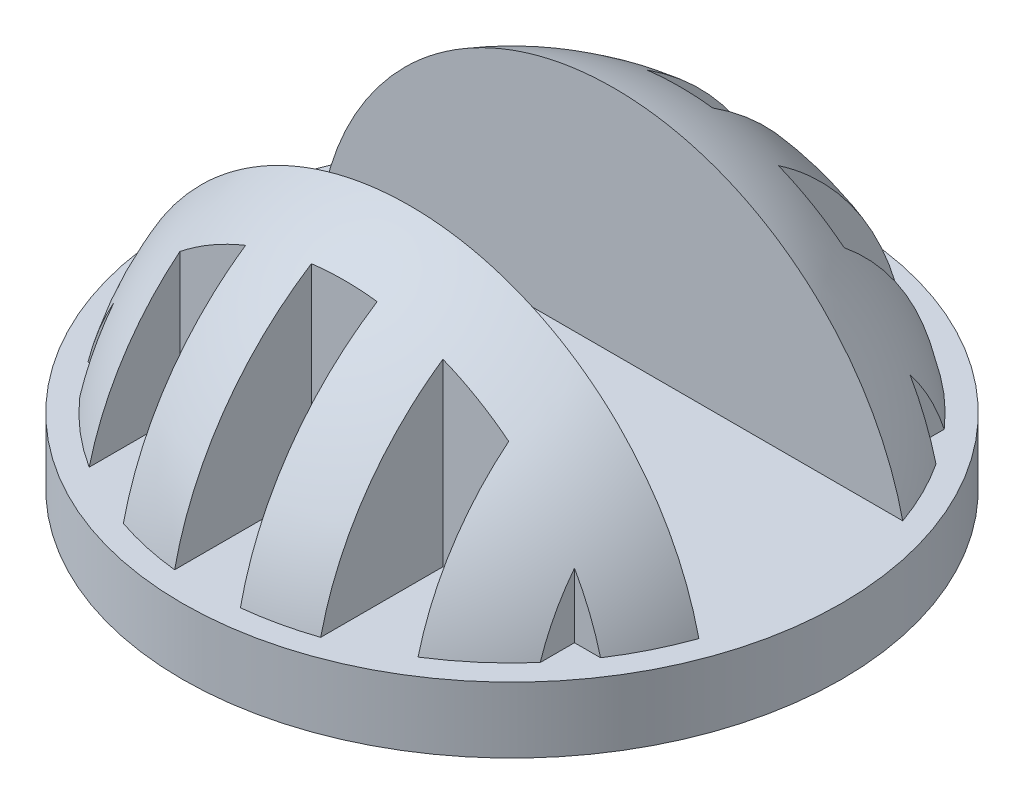
ISO-10303-21;
HEADER;
FILE_DESCRIPTION(('STEP AP214'),'2;1');
FILE_NAME('part.step','',(''),(''),'','','');
FILE_SCHEMA(('AUTOMOTIVE_DESIGN { 1 0 10303 214 1 1 1 1 }'));
ENDSEC;
DATA;
#1=APPLICATION_CONTEXT('core data for automotive mechanical design processes');
#2=APPLICATION_PROTOCOL_DEFINITION('international standard','automotive_design',2000,#1);
#3=PRODUCT_CONTEXT('',#1,'mechanical');
#4=PRODUCT('Part','Part','',(#3));
#5=PRODUCT_RELATED_PRODUCT_CATEGORY('part','',(#4));
#6=PRODUCT_DEFINITION_FORMATION('','',#4);
#7=PRODUCT_DEFINITION_CONTEXT('part definition',#1,'design');
#8=PRODUCT_DEFINITION('design','',#6,#7);
#9=PRODUCT_DEFINITION_SHAPE('','',#8);
#10=(LENGTH_UNIT() NAMED_UNIT(*) SI_UNIT(.MILLI.,.METRE.));
#11=(NAMED_UNIT(*) PLANE_ANGLE_UNIT() SI_UNIT($,.RADIAN.));
#12=(NAMED_UNIT(*) SI_UNIT($,.STERADIAN.) SOLID_ANGLE_UNIT());
#13=UNCERTAINTY_MEASURE_WITH_UNIT(LENGTH_MEASURE(1.E-05),#10,'distance_accuracy_value','');
#14=(GEOMETRIC_REPRESENTATION_CONTEXT(3) GLOBAL_UNCERTAINTY_ASSIGNED_CONTEXT((#13)) GLOBAL_UNIT_ASSIGNED_CONTEXT((#10,
#11,#12)) REPRESENTATION_CONTEXT('',''));
#15=CARTESIAN_POINT('',(0.,0.,0.));
#16=DIRECTION('',(0.,0.,1.));
#17=DIRECTION('',(1.,0.,0.));
#18=AXIS2_PLACEMENT_3D('',#15,#16,#17);
#19=CARTESIAN_POINT('',(0.,0.,0.));
#20=DIRECTION('',(0.,-1.,0.));
#21=DIRECTION('',(1.,0.,0.));
#22=AXIS2_PLACEMENT_3D('',#19,#20,#21);
#23=SPHERICAL_SURFACE('',#22,9.525);
#24=CARTESIAN_POINT('',(-7.,0.,0.));
#25=DIRECTION('',(-1.,0.,0.));
#26=DIRECTION('',(0.,0.,1.));
#27=AXIS2_PLACEMENT_3D('',#24,#25,#26);
#28=CIRCLE('',#27,6.45953752214507);
#29=CARTESIAN_POINT('',(-7.,2.,-6.14211893404874));
#30=VERTEX_POINT('',#29);
#31=CARTESIAN_POINT('',(-7.,3.96429375803567,-5.09999999999994));
#32=VERTEX_POINT('',#31);
#33=EDGE_CURVE('E232',#30,#32,#28,.F.);
#34=ORIENTED_EDGE('',*,*,#33,.T.);
#35=CARTESIAN_POINT('',(0.,0.,-5.09999999999994));
#36=DIRECTION('',(0.,0.,-1.));
#37=DIRECTION('',(-1.,0.,0.));
#38=AXIS2_PLACEMENT_3D('',#35,#36,#37);
#39=CIRCLE('',#38,8.04460222758096);
#40=CARTESIAN_POINT('',(-7.79202316475,2.,-5.09999999999994));
#41=VERTEX_POINT('',#40);
#42=EDGE_CURVE('E229',#32,#41,#39,.F.);
#43=ORIENTED_EDGE('',*,*,#42,.T.);
#44=CARTESIAN_POINT('',(0.,2.,0.));
#45=DIRECTION('',(0.,-1.,0.));
#46=DIRECTION('',(0.,0.,-1.));
#47=AXIS2_PLACEMENT_3D('',#44,#45,#46);
#48=CIRCLE('',#47,9.31265939460904);
#49=CARTESIAN_POINT('',(-8.78155026177041,2.,-3.1));
#50=VERTEX_POINT('',#49);
#51=EDGE_CURVE('E222',#41,#50,#48,.F.);
#52=ORIENTED_EDGE('',*,*,#51,.T.);
#53=CARTESIAN_POINT('',(0.,0.,-3.1));
#54=DIRECTION('',(0.,0.,1.));
#55=DIRECTION('',(1.,0.,0.));
#56=AXIS2_PLACEMENT_3D('',#53,#54,#55);
#57=CIRCLE('',#56,9.00642132036915);
#58=CARTESIAN_POINT('',(8.78155026177041,2.,-3.1));
#59=VERTEX_POINT('',#58);
#60=EDGE_CURVE('E398',#50,#59,#57,.F.);
#61=ORIENTED_EDGE('',*,*,#60,.T.);
#62=CARTESIAN_POINT('',(7.79202316474996,2.,-5.1));
#63=VERTEX_POINT('',#62);
#64=EDGE_CURVE('E407',#59,#63,#48,.F.);
#65=ORIENTED_EDGE('',*,*,#64,.T.);
#66=CARTESIAN_POINT('',(0.,0.,-5.1));
#67=DIRECTION('',(0.,0.,-1.));
#68=DIRECTION('',(-1.,0.,0.));
#69=AXIS2_PLACEMENT_3D('',#66,#67,#68);
#70=CIRCLE('',#69,8.04460222758093);
#71=CARTESIAN_POINT('',(7.,3.9642937580356,-5.1));
#72=VERTEX_POINT('',#71);
#73=EDGE_CURVE('E277',#63,#72,#70,.F.);
#74=ORIENTED_EDGE('',*,*,#73,.T.);
#75=CARTESIAN_POINT('',(7.,0.,0.));
#76=DIRECTION('',(1.,0.,0.));
#77=DIRECTION('',(0.,0.,-1.));
#78=AXIS2_PLACEMENT_3D('',#75,#76,#77);
#79=CIRCLE('',#78,6.45953752214507);
#80=CARTESIAN_POINT('',(7.,2.,-6.14211893404874));
#81=VERTEX_POINT('',#80);
#82=EDGE_CURVE('E280',#72,#81,#79,.F.);
#83=ORIENTED_EDGE('',*,*,#82,.T.);
#84=CARTESIAN_POINT('',(5.,2.,-7.85656572555719));
#85=VERTEX_POINT('',#84);
#86=EDGE_CURVE('E411',#81,#85,#48,.F.);
#87=ORIENTED_EDGE('',*,*,#86,.T.);
#88=CARTESIAN_POINT('',(5.,0.,0.));
#89=DIRECTION('',(-1.,0.,0.));
#90=DIRECTION('',(0.,0.,1.));
#91=AXIS2_PLACEMENT_3D('',#88,#89,#90);
#92=CIRCLE('',#91,8.10713420389721);
#93=CARTESIAN_POINT('',(5.,6.30203340200605,-5.1));
#94=VERTEX_POINT('',#93);
#95=EDGE_CURVE('E309',#85,#94,#92,.F.);
#96=ORIENTED_EDGE('',*,*,#95,.T.);
#97=CARTESIAN_POINT('',(0.,0.,-5.1));
#98=DIRECTION('',(0.,0.,-1.));
#99=DIRECTION('',(-1.,0.,0.));
#100=AXIS2_PLACEMENT_3D('',#97,#98,#99);
#101=CIRCLE('',#100,8.04460222758093);
#102=CARTESIAN_POINT('',(3.,7.46428998632824,-5.1));
#103=VERTEX_POINT('',#102);
#104=EDGE_CURVE('E40',#94,#103,#101,.F.);
#105=ORIENTED_EDGE('',*,*,#104,.T.);
#106=CARTESIAN_POINT('',(3.,0.,0.));
#107=DIRECTION('',(1.,0.,0.));
#108=DIRECTION('',(0.,0.,-1.));
#109=AXIS2_PLACEMENT_3D('',#106,#107,#108);
#110=CIRCLE('',#109,9.04022261894031);
#111=CARTESIAN_POINT('',(3.,2.,-8.81621375648299));
#112=VERTEX_POINT('',#111);
#113=EDGE_CURVE('E312',#103,#112,#110,.F.);
#114=ORIENTED_EDGE('',*,*,#113,.T.);
#115=CARTESIAN_POINT('',(1.,2.,-9.25881336889345));
#116=VERTEX_POINT('',#115);
#117=EDGE_CURVE('E437',#112,#116,#48,.F.);
#118=ORIENTED_EDGE('',*,*,#117,.T.);
#119=CARTESIAN_POINT('',(1.,0.,0.));
#120=DIRECTION('',(-1.,0.,0.));
#121=DIRECTION('',(0.,0.,1.));
#122=AXIS2_PLACEMENT_3D('',#119,#120,#121);
#123=CIRCLE('',#122,9.47236111009288);
#124=CARTESIAN_POINT('',(1.,7.98220677507167,-5.1));
#125=VERTEX_POINT('',#124);
#126=EDGE_CURVE('E365',#116,#125,#123,.F.);
#127=ORIENTED_EDGE('',*,*,#126,.T.);
#128=CARTESIAN_POINT('',(0.,0.,-5.1));
#129=DIRECTION('',(0.,0.,-1.));
#130=DIRECTION('',(-1.,0.,0.));
#131=AXIS2_PLACEMENT_3D('',#128,#129,#130);
#132=CIRCLE('',#131,8.04460222758093);
#133=CARTESIAN_POINT('',(-1.,7.98220677507167,-5.1));
#134=VERTEX_POINT('',#133);
#135=EDGE_CURVE('E416',#125,#134,#132,.F.);
#136=ORIENTED_EDGE('',*,*,#135,.T.);
#137=CARTESIAN_POINT('',(-1.,0.,0.));
#138=DIRECTION('',(1.,0.,0.));
#139=DIRECTION('',(0.,0.,-1.));
#140=AXIS2_PLACEMENT_3D('',#137,#138,#139);
#141=CIRCLE('',#140,9.47236111009288);
#142=CARTESIAN_POINT('',(-1.,2.,-9.25881336889345));
#143=VERTEX_POINT('',#142);
#144=EDGE_CURVE('E368',#134,#143,#141,.F.);
#145=ORIENTED_EDGE('',*,*,#144,.T.);
#146=CARTESIAN_POINT('',(-3.,2.,-8.81621375648299));
#147=VERTEX_POINT('',#146);
#148=EDGE_CURVE('E477',#143,#147,#48,.F.);
#149=ORIENTED_EDGE('',*,*,#148,.T.);
#150=CARTESIAN_POINT('',(-3.,0.,0.));
#151=DIRECTION('',(-1.,0.,0.));
#152=DIRECTION('',(0.,0.,1.));
#153=AXIS2_PLACEMENT_3D('',#150,#151,#152);
#154=CIRCLE('',#153,9.04022261894031);
#155=CARTESIAN_POINT('',(-3.,7.46428998632826,-5.09999999999997));
#156=VERTEX_POINT('',#155);
#157=EDGE_CURVE('E264',#147,#156,#154,.F.);
#158=ORIENTED_EDGE('',*,*,#157,.T.);
#159=CARTESIAN_POINT('',(0.,0.,-5.09999999999997));
#160=DIRECTION('',(0.,0.,-1.));
#161=DIRECTION('',(-1.,0.,0.));
#162=AXIS2_PLACEMENT_3D('',#159,#160,#161);
#163=CIRCLE('',#162,8.04460222758094);
#164=CARTESIAN_POINT('',(-5.,6.30203340200608,-5.09999999999997));
#165=VERTEX_POINT('',#164);
#166=EDGE_CURVE('E11',#156,#165,#163,.F.);
#167=ORIENTED_EDGE('',*,*,#166,.T.);
#168=CARTESIAN_POINT('',(-5.,0.,0.));
#169=DIRECTION('',(1.,0.,0.));
#170=DIRECTION('',(0.,0.,-1.));
#171=AXIS2_PLACEMENT_3D('',#168,#169,#170);
#172=CIRCLE('',#171,8.10713420389721);
#173=CARTESIAN_POINT('',(-5.,2.,-7.85656572555719));
#174=VERTEX_POINT('',#173);
#175=EDGE_CURVE('E267',#165,#174,#172,.F.);
#176=ORIENTED_EDGE('',*,*,#175,.T.);
#177=EDGE_CURVE('E474',#174,#30,#48,.F.);
#178=ORIENTED_EDGE('',*,*,#177,.T.);
#179=EDGE_LOOP('',(#34,#43,#52,#61,#65,#74,#83,#87,#96,#105,#114,#118,#127,#136,#145,#149,#158,
#167,#176,#178));
#180=FACE_BOUND('',#179,.T.);
#181=ADVANCED_FACE('F33',(#180),#23,.T.);
#182=CARTESIAN_POINT('',(0.,0.,5.10000000000006));
#183=DIRECTION('',(0.,0.,1.));
#184=DIRECTION('',(1.,0.,0.));
#185=AXIS2_PLACEMENT_3D('',#182,#183,#184);
#186=CIRCLE('',#185,8.04460222758089);
#187=CARTESIAN_POINT('',(-7.79202316474992,2.,5.10000000000006));
#188=VERTEX_POINT('',#187);
#189=CARTESIAN_POINT('',(-7.,3.96429375803553,5.10000000000006));
#190=VERTEX_POINT('',#189);
#191=EDGE_CURVE('E246',#188,#190,#186,.F.);
#192=ORIENTED_EDGE('',*,*,#191,.T.);
#193=CARTESIAN_POINT('',(-7.,0.,0.));
#194=DIRECTION('',(-1.,0.,0.));
#195=DIRECTION('',(0.,0.,1.));
#196=AXIS2_PLACEMENT_3D('',#193,#194,#195);
#197=CIRCLE('',#196,6.45953752214507);
#198=CARTESIAN_POINT('',(-7.,2.,6.14211893404874));
#199=VERTEX_POINT('',#198);
#200=EDGE_CURVE('E249',#190,#199,#197,.F.);
#201=ORIENTED_EDGE('',*,*,#200,.T.);
#202=CARTESIAN_POINT('',(-5.,2.,7.85656572555719));
#203=VERTEX_POINT('',#202);
#204=EDGE_CURVE('E470',#199,#203,#48,.F.);
#205=ORIENTED_EDGE('',*,*,#204,.T.);
#206=CARTESIAN_POINT('',(-5.,0.,0.));
#207=DIRECTION('',(1.,0.,0.));
#208=DIRECTION('',(0.,0.,-1.));
#209=AXIS2_PLACEMENT_3D('',#206,#207,#208);
#210=CIRCLE('',#209,8.10713420389721);
#211=CARTESIAN_POINT('',(-5.,6.30203340200603,5.10000000000003));
#212=VERTEX_POINT('',#211);
#213=EDGE_CURVE('E331',#203,#212,#210,.F.);
#214=ORIENTED_EDGE('',*,*,#213,.T.);
#215=CARTESIAN_POINT('',(0.,0.,5.10000000000003));
#216=DIRECTION('',(0.,0.,1.));
#217=DIRECTION('',(1.,0.,0.));
#218=AXIS2_PLACEMENT_3D('',#215,#216,#217);
#219=CIRCLE('',#218,8.04460222758091);
#220=CARTESIAN_POINT('',(-3.,7.46428998632822,5.10000000000003));
#221=VERTEX_POINT('',#220);
#222=EDGE_CURVE('E422',#212,#221,#219,.F.);
#223=ORIENTED_EDGE('',*,*,#222,.T.);
#224=CARTESIAN_POINT('',(-3.,0.,0.));
#225=DIRECTION('',(-1.,0.,0.));
#226=DIRECTION('',(0.,0.,1.));
#227=AXIS2_PLACEMENT_3D('',#224,#225,#226);
#228=CIRCLE('',#227,9.04022261894031);
#229=CARTESIAN_POINT('',(-3.,2.,8.81621375648299));
#230=VERTEX_POINT('',#229);
#231=EDGE_CURVE('E328',#221,#230,#228,.F.);
#232=ORIENTED_EDGE('',*,*,#231,.T.);
#233=CARTESIAN_POINT('',(-1.,2.,9.25881336889345));
#234=VERTEX_POINT('',#233);
#235=EDGE_CURVE('E473',#230,#234,#48,.F.);
#236=ORIENTED_EDGE('',*,*,#235,.T.);
#237=CARTESIAN_POINT('',(-1.,0.,0.));
#238=DIRECTION('',(1.,0.,0.));
#239=DIRECTION('',(0.,0.,-1.));
#240=AXIS2_PLACEMENT_3D('',#237,#238,#239);
#241=CIRCLE('',#240,9.47236111009288);
#242=CARTESIAN_POINT('',(-1.,7.98220677507167,5.1));
#243=VERTEX_POINT('',#242);
#244=EDGE_CURVE('E387',#234,#243,#241,.F.);
#245=ORIENTED_EDGE('',*,*,#244,.T.);
#246=CARTESIAN_POINT('',(0.,0.,5.1));
#247=DIRECTION('',(0.,0.,1.));
#248=DIRECTION('',(1.,0.,0.));
#249=AXIS2_PLACEMENT_3D('',#246,#247,#248);
#250=CIRCLE('',#249,8.04460222758093);
#251=CARTESIAN_POINT('',(1.,7.98220677507167,5.1));
#252=VERTEX_POINT('',#251);
#253=EDGE_CURVE('E413',#243,#252,#250,.F.);
#254=ORIENTED_EDGE('',*,*,#253,.T.);
#255=CARTESIAN_POINT('',(1.,0.,0.));
#256=DIRECTION('',(-1.,0.,0.));
#257=DIRECTION('',(0.,0.,1.));
#258=AXIS2_PLACEMENT_3D('',#255,#256,#257);
#259=CIRCLE('',#258,9.47236111009288);
#260=CARTESIAN_POINT('',(1.,2.,9.25881336889345));
#261=VERTEX_POINT('',#260);
#262=EDGE_CURVE('E384',#252,#261,#259,.F.);
#263=ORIENTED_EDGE('',*,*,#262,.T.);
#264=CARTESIAN_POINT('',(3.,2.,8.81621375648299));
#265=VERTEX_POINT('',#264);
#266=EDGE_CURVE('E475',#261,#265,#48,.F.);
#267=ORIENTED_EDGE('',*,*,#266,.T.);
#268=CARTESIAN_POINT('',(3.,0.,0.));
#269=DIRECTION('',(1.,0.,0.));
#270=DIRECTION('',(0.,0.,-1.));
#271=AXIS2_PLACEMENT_3D('',#268,#269,#270);
#272=CIRCLE('',#271,9.04022261894031);
#273=CARTESIAN_POINT('',(3.,7.46428998632824,5.1));
#274=VERTEX_POINT('',#273);
#275=EDGE_CURVE('E349',#265,#274,#272,.F.);
#276=ORIENTED_EDGE('',*,*,#275,.T.);
#277=CARTESIAN_POINT('',(0.,0.,5.1));
#278=DIRECTION('',(0.,0.,1.));
#279=DIRECTION('',(1.,0.,0.));
#280=AXIS2_PLACEMENT_3D('',#277,#278,#279);
#281=CIRCLE('',#280,8.04460222758093);
#282=CARTESIAN_POINT('',(5.,6.30203340200605,5.1));
#283=VERTEX_POINT('',#282);
#284=EDGE_CURVE('E419',#274,#283,#281,.F.);
#285=ORIENTED_EDGE('',*,*,#284,.T.);
#286=CARTESIAN_POINT('',(5.,0.,0.));
#287=DIRECTION('',(-1.,0.,0.));
#288=DIRECTION('',(0.,0.,1.));
#289=AXIS2_PLACEMENT_3D('',#286,#287,#288);
#290=CIRCLE('',#289,8.10713420389721);
#291=CARTESIAN_POINT('',(5.,2.,7.85656572555719));
#292=VERTEX_POINT('',#291);
#293=EDGE_CURVE('E346',#283,#292,#290,.F.);
#294=ORIENTED_EDGE('',*,*,#293,.T.);
#295=CARTESIAN_POINT('',(7.,2.,6.14211893404874));
#296=VERTEX_POINT('',#295);
#297=EDGE_CURVE('E476',#292,#296,#48,.F.);
#298=ORIENTED_EDGE('',*,*,#297,.T.);
#299=CARTESIAN_POINT('',(7.,0.,0.));
#300=DIRECTION('',(1.,0.,0.));
#301=DIRECTION('',(0.,0.,-1.));
#302=AXIS2_PLACEMENT_3D('',#299,#300,#301);
#303=CIRCLE('',#302,6.45953752214507);
#304=CARTESIAN_POINT('',(7.,3.9642937580356,5.1));
#305=VERTEX_POINT('',#304);
#306=EDGE_CURVE('E293',#296,#305,#303,.F.);
#307=ORIENTED_EDGE('',*,*,#306,.T.);
#308=CARTESIAN_POINT('',(0.,0.,5.1));
#309=DIRECTION('',(0.,0.,1.));
#310=DIRECTION('',(1.,0.,0.));
#311=AXIS2_PLACEMENT_3D('',#308,#309,#310);
#312=CIRCLE('',#311,8.04460222758093);
#313=CARTESIAN_POINT('',(7.79202316474996,2.,5.1));
#314=VERTEX_POINT('',#313);
#315=EDGE_CURVE('E290',#305,#314,#312,.F.);
#316=ORIENTED_EDGE('',*,*,#315,.T.);
#317=CARTESIAN_POINT('',(8.78155026177041,2.,3.1));
#318=VERTEX_POINT('',#317);
#319=EDGE_CURVE('E410',#314,#318,#48,.F.);
#320=ORIENTED_EDGE('',*,*,#319,.T.);
#321=CARTESIAN_POINT('',(0.,0.,3.1));
#322=DIRECTION('',(0.,0.,-1.));
#323=DIRECTION('',(-1.,0.,0.));
#324=AXIS2_PLACEMENT_3D('',#321,#322,#323);
#325=CIRCLE('',#324,9.00642132036915);
#326=CARTESIAN_POINT('',(-8.78155026177041,2.,3.1));
#327=VERTEX_POINT('',#326);
#328=EDGE_CURVE('E395',#318,#327,#325,.F.);
#329=ORIENTED_EDGE('',*,*,#328,.T.);
#330=EDGE_CURVE('E412',#327,#188,#48,.F.);
#331=ORIENTED_EDGE('',*,*,#330,.T.);
#332=EDGE_LOOP('',(#192,#201,#205,#214,#223,#232,#236,#245,#254,#263,#267,#276,#285,#294,#298,
#307,#316,#320,#329,#331));
#333=FACE_BOUND('',#332,.T.);
#334=ADVANCED_FACE('F452',(#333),#23,.T.);
#335=CARTESIAN_POINT('',(0.,2.,0.));
#336=DIRECTION('',(0.,-1.,0.));
#337=DIRECTION('',(0.,0.,-1.));
#338=AXIS2_PLACEMENT_3D('',#335,#336,#337);
#339=CYLINDRICAL_SURFACE('',#338,10.025);
#340=CARTESIAN_POINT('',(0.,2.,0.));
#341=DIRECTION('',(0.,-1.,0.));
#342=DIRECTION('',(0.,0.,-1.));
#343=AXIS2_PLACEMENT_3D('',#340,#341,#342);
#344=CIRCLE('',#343,10.025);
#345=CARTESIAN_POINT('',(0.,2.,-10.025));
#346=VERTEX_POINT('',#345);
#347=EDGE_CURVE('E402',#346,#346,#344,.T.);
#348=ORIENTED_EDGE('',*,*,#347,.T.);
#349=EDGE_LOOP('',(#348));
#350=FACE_BOUND('',#349,.T.);
#351=CARTESIAN_POINT('',(0.,0.,0.));
#352=DIRECTION('',(0.,-1.,0.));
#353=DIRECTION('',(0.,0.,-1.));
#354=AXIS2_PLACEMENT_3D('',#351,#352,#353);
#355=CIRCLE('',#354,10.025);
#356=CARTESIAN_POINT('',(0.,0.,-10.025));
#357=VERTEX_POINT('',#356);
#358=EDGE_CURVE('E401',#357,#357,#355,.T.);
#359=ORIENTED_EDGE('',*,*,#358,.F.);
#360=EDGE_LOOP('',(#359));
#361=FACE_BOUND('',#360,.T.);
#362=ADVANCED_FACE('F456',(#350,#361),#339,.T.);
#363=CARTESIAN_POINT('',(0.,2.,0.));
#364=DIRECTION('',(0.,-1.,0.));
#365=DIRECTION('',(0.,0.,-1.));
#366=AXIS2_PLACEMENT_3D('',#363,#364,#365);
#367=PLANE('',#366);
#368=ORIENTED_EDGE('',*,*,#51,.F.);
#369=DIRECTION('',(1.,0.,0.));
#370=VECTOR('',#369,1.);
#371=CARTESIAN_POINT('',(-9.,2.,-5.09999999999994));
#372=LINE('',#371,#370);
#373=CARTESIAN_POINT('',(-7.,2.,-5.09999999999994));
#374=VERTEX_POINT('',#373);
#375=EDGE_CURVE('E217',#41,#374,#372,.T.);
#376=ORIENTED_EDGE('',*,*,#375,.T.);
#377=DIRECTION('',(0.,0.,-1.));
#378=VECTOR('',#377,1.);
#379=CARTESIAN_POINT('',(-7.,2.,-5.09999999999994));
#380=LINE('',#379,#378);
#381=EDGE_CURVE('E47',#374,#30,#380,.T.);
#382=ORIENTED_EDGE('',*,*,#381,.T.);
#383=ORIENTED_EDGE('',*,*,#177,.F.);
#384=DIRECTION('',(0.,0.,1.));
#385=VECTOR('',#384,1.);
#386=CARTESIAN_POINT('',(-5.,2.,-5.09999999999997));
#387=LINE('',#386,#385);
#388=CARTESIAN_POINT('',(-5.,2.,-5.09999999999997));
#389=VERTEX_POINT('',#388);
#390=EDGE_CURVE('E252',#174,#389,#387,.T.);
#391=ORIENTED_EDGE('',*,*,#390,.T.);
#392=DIRECTION('',(1.,0.,0.));
#393=VECTOR('',#392,1.);
#394=CARTESIAN_POINT('',(-5.,2.,-5.09999999999997));
#395=LINE('',#394,#393);
#396=CARTESIAN_POINT('',(-3.,2.,-5.09999999999997));
#397=VERTEX_POINT('',#396);
#398=EDGE_CURVE('E255',#389,#397,#395,.T.);
#399=ORIENTED_EDGE('',*,*,#398,.T.);
#400=DIRECTION('',(0.,0.,-1.));
#401=VECTOR('',#400,1.);
#402=CARTESIAN_POINT('',(-3.,2.,-5.09999999999997));
#403=LINE('',#402,#401);
#404=EDGE_CURVE('E258',#397,#147,#403,.T.);
#405=ORIENTED_EDGE('',*,*,#404,.T.);
#406=ORIENTED_EDGE('',*,*,#148,.F.);
#407=DIRECTION('',(0.,0.,1.));
#408=VECTOR('',#407,1.);
#409=CARTESIAN_POINT('',(-1.,2.,-5.1));
#410=LINE('',#409,#408);
#411=CARTESIAN_POINT('',(-1.,2.,-5.1));
#412=VERTEX_POINT('',#411);
#413=EDGE_CURVE('E352',#143,#412,#410,.T.);
#414=ORIENTED_EDGE('',*,*,#413,.T.);
#415=DIRECTION('',(1.,0.,0.));
#416=VECTOR('',#415,1.);
#417=CARTESIAN_POINT('',(-1.,2.,-5.1));
#418=LINE('',#417,#416);
#419=CARTESIAN_POINT('',(1.,2.,-5.1));
#420=VERTEX_POINT('',#419);
#421=EDGE_CURVE('E355',#412,#420,#418,.T.);
#422=ORIENTED_EDGE('',*,*,#421,.T.);
#423=DIRECTION('',(0.,0.,-1.));
#424=VECTOR('',#423,1.);
#425=CARTESIAN_POINT('',(1.,2.,-5.1));
#426=LINE('',#425,#424);
#427=EDGE_CURVE('E358',#420,#116,#426,.T.);
#428=ORIENTED_EDGE('',*,*,#427,.T.);
#429=ORIENTED_EDGE('',*,*,#117,.F.);
#430=DIRECTION('',(0.,0.,1.));
#431=VECTOR('',#430,1.);
#432=CARTESIAN_POINT('',(3.,2.,-5.1));
#433=LINE('',#432,#431);
#434=CARTESIAN_POINT('',(3.,2.,-5.1));
#435=VERTEX_POINT('',#434);
#436=EDGE_CURVE('E296',#112,#435,#433,.T.);
#437=ORIENTED_EDGE('',*,*,#436,.T.);
#438=DIRECTION('',(1.,0.,0.));
#439=VECTOR('',#438,1.);
#440=CARTESIAN_POINT('',(3.,2.,-5.1));
#441=LINE('',#440,#439);
#442=CARTESIAN_POINT('',(5.,2.,-5.1));
#443=VERTEX_POINT('',#442);
#444=EDGE_CURVE('E299',#435,#443,#441,.T.);
#445=ORIENTED_EDGE('',*,*,#444,.T.);
#446=DIRECTION('',(0.,0.,-1.));
#447=VECTOR('',#446,1.);
#448=CARTESIAN_POINT('',(5.,2.,-5.1));
#449=LINE('',#448,#447);
#450=EDGE_CURVE('E302',#443,#85,#449,.T.);
#451=ORIENTED_EDGE('',*,*,#450,.T.);
#452=ORIENTED_EDGE('',*,*,#86,.F.);
#453=DIRECTION('',(0.,0.,1.));
#454=VECTOR('',#453,1.);
#455=CARTESIAN_POINT('',(7.,2.,-5.1));
#456=LINE('',#455,#454);
#457=CARTESIAN_POINT('',(7.,2.,-5.1));
#458=VERTEX_POINT('',#457);
#459=EDGE_CURVE('E270',#81,#458,#456,.T.);
#460=ORIENTED_EDGE('',*,*,#459,.T.);
#461=DIRECTION('',(1.,0.,0.));
#462=VECTOR('',#461,1.);
#463=CARTESIAN_POINT('',(7.,2.,-5.1));
#464=LINE('',#463,#462);
#465=EDGE_CURVE('E272',#458,#63,#464,.T.);
#466=ORIENTED_EDGE('',*,*,#465,.T.);
#467=ORIENTED_EDGE('',*,*,#64,.F.);
#468=DIRECTION('',(-1.,0.,0.));
#469=VECTOR('',#468,1.);
#470=CARTESIAN_POINT('',(-9.53365748283418,2.,-3.1));
#471=LINE('',#470,#469);
#472=EDGE_CURVE('E390',#59,#50,#471,.T.);
#473=ORIENTED_EDGE('',*,*,#472,.T.);
#474=EDGE_LOOP('',(#368,#376,#382,#383,#391,#399,#405,#406,#414,#422,#428,#429,#437,#445,#451,
#452,#460,#466,#467,#473));
#475=FACE_BOUND('',#474,.T.);
#476=ORIENTED_EDGE('',*,*,#347,.F.);
#477=EDGE_LOOP('',(#476));
#478=FACE_BOUND('',#477,.T.);
#479=ORIENTED_EDGE('',*,*,#204,.F.);
#480=DIRECTION('',(0.,0.,-1.));
#481=VECTOR('',#480,1.);
#482=CARTESIAN_POINT('',(-7.,2.,5.10000000000006));
#483=LINE('',#482,#481);
#484=CARTESIAN_POINT('',(-7.,2.,5.10000000000006));
#485=VERTEX_POINT('',#484);
#486=EDGE_CURVE('E240',#199,#485,#483,.T.);
#487=ORIENTED_EDGE('',*,*,#486,.T.);
#488=DIRECTION('',(-1.,0.,0.));
#489=VECTOR('',#488,1.);
#490=CARTESIAN_POINT('',(-9.,2.,5.10000000000006));
#491=LINE('',#490,#489);
#492=EDGE_CURVE('E55',#485,#188,#491,.T.);
#493=ORIENTED_EDGE('',*,*,#492,.T.);
#494=ORIENTED_EDGE('',*,*,#330,.F.);
#495=DIRECTION('',(1.,0.,0.));
#496=VECTOR('',#495,1.);
#497=CARTESIAN_POINT('',(9.53365748283417,2.,3.1));
#498=LINE('',#497,#496);
#499=EDGE_CURVE('E392',#327,#318,#498,.T.);
#500=ORIENTED_EDGE('',*,*,#499,.T.);
#501=ORIENTED_EDGE('',*,*,#319,.F.);
#502=DIRECTION('',(-1.,0.,0.));
#503=VECTOR('',#502,1.);
#504=CARTESIAN_POINT('',(7.,2.,5.1));
#505=LINE('',#504,#503);
#506=CARTESIAN_POINT('',(7.,2.,5.1));
#507=VERTEX_POINT('',#506);
#508=EDGE_CURVE('E285',#314,#507,#505,.T.);
#509=ORIENTED_EDGE('',*,*,#508,.T.);
#510=DIRECTION('',(0.,0.,1.));
#511=VECTOR('',#510,1.);
#512=CARTESIAN_POINT('',(7.,2.,5.1));
#513=LINE('',#512,#511);
#514=EDGE_CURVE('E283',#507,#296,#513,.T.);
#515=ORIENTED_EDGE('',*,*,#514,.T.);
#516=ORIENTED_EDGE('',*,*,#297,.F.);
#517=DIRECTION('',(0.,0.,-1.));
#518=VECTOR('',#517,1.);
#519=CARTESIAN_POINT('',(5.,2.,5.1));
#520=LINE('',#519,#518);
#521=CARTESIAN_POINT('',(5.,2.,5.1));
#522=VERTEX_POINT('',#521);
#523=EDGE_CURVE('E336',#292,#522,#520,.T.);
#524=ORIENTED_EDGE('',*,*,#523,.T.);
#525=DIRECTION('',(-1.,0.,0.));
#526=VECTOR('',#525,1.);
#527=CARTESIAN_POINT('',(3.,2.,5.1));
#528=LINE('',#527,#526);
#529=CARTESIAN_POINT('',(3.,2.,5.1));
#530=VERTEX_POINT('',#529);
#531=EDGE_CURVE('E339',#522,#530,#528,.T.);
#532=ORIENTED_EDGE('',*,*,#531,.T.);
#533=DIRECTION('',(0.,0.,1.));
#534=VECTOR('',#533,1.);
#535=CARTESIAN_POINT('',(3.,2.,5.1));
#536=LINE('',#535,#534);
#537=EDGE_CURVE('E334',#530,#265,#536,.T.);
#538=ORIENTED_EDGE('',*,*,#537,.T.);
#539=ORIENTED_EDGE('',*,*,#266,.F.);
#540=DIRECTION('',(0.,0.,-1.));
#541=VECTOR('',#540,1.);
#542=CARTESIAN_POINT('',(1.,2.,5.1));
#543=LINE('',#542,#541);
#544=CARTESIAN_POINT('',(1.,2.,5.1));
#545=VERTEX_POINT('',#544);
#546=EDGE_CURVE('E374',#261,#545,#543,.T.);
#547=ORIENTED_EDGE('',*,*,#546,.T.);
#548=DIRECTION('',(-1.,0.,0.));
#549=VECTOR('',#548,1.);
#550=CARTESIAN_POINT('',(-1.,2.,5.1));
#551=LINE('',#550,#549);
#552=CARTESIAN_POINT('',(-1.,2.,5.1));
#553=VERTEX_POINT('',#552);
#554=EDGE_CURVE('E377',#545,#553,#551,.T.);
#555=ORIENTED_EDGE('',*,*,#554,.T.);
#556=DIRECTION('',(0.,0.,1.));
#557=VECTOR('',#556,1.);
#558=CARTESIAN_POINT('',(-1.,2.,5.1));
#559=LINE('',#558,#557);
#560=EDGE_CURVE('E371',#553,#234,#559,.T.);
#561=ORIENTED_EDGE('',*,*,#560,.T.);
#562=ORIENTED_EDGE('',*,*,#235,.F.);
#563=DIRECTION('',(0.,0.,-1.));
#564=VECTOR('',#563,1.);
#565=CARTESIAN_POINT('',(-3.,2.,5.10000000000003));
#566=LINE('',#565,#564);
#567=CARTESIAN_POINT('',(-3.,2.,5.10000000000003));
#568=VERTEX_POINT('',#567);
#569=EDGE_CURVE('E318',#230,#568,#566,.T.);
#570=ORIENTED_EDGE('',*,*,#569,.T.);
#571=DIRECTION('',(-1.,0.,0.));
#572=VECTOR('',#571,1.);
#573=CARTESIAN_POINT('',(-5.,2.,5.10000000000003));
#574=LINE('',#573,#572);
#575=CARTESIAN_POINT('',(-5.,2.,5.10000000000003));
#576=VERTEX_POINT('',#575);
#577=EDGE_CURVE('E321',#568,#576,#574,.T.);
#578=ORIENTED_EDGE('',*,*,#577,.T.);
#579=DIRECTION('',(0.,0.,1.));
#580=VECTOR('',#579,1.);
#581=CARTESIAN_POINT('',(-5.,2.,5.10000000000003));
#582=LINE('',#581,#580);
#583=EDGE_CURVE('E315',#576,#203,#582,.T.);
#584=ORIENTED_EDGE('',*,*,#583,.T.);
#585=EDGE_LOOP('',(#479,#487,#493,#494,#500,#501,#509,#515,#516,#524,#532,#538,#539,#547,#555,
#561,#562,#570,#578,#584));
#586=FACE_BOUND('',#585,.T.);
#587=ADVANCED_FACE('F219',(#475,#478,#586),#367,.F.);
#588=CARTESIAN_POINT('',(9.525,0.,0.));
#589=DIRECTION('',(0.,-1.,0.));
#590=DIRECTION('',(0.,0.,-1.));
#591=AXIS2_PLACEMENT_3D('',#588,#589,#590);
#592=PLANE('',#591);
#593=ORIENTED_EDGE('',*,*,#358,.T.);
#594=EDGE_LOOP('',(#593));
#595=FACE_BOUND('',#594,.T.);
#596=ADVANCED_FACE('F617',(#595),#592,.T.);
#597=CARTESIAN_POINT('',(-9.53365748283418,9.525,-3.1));
#598=DIRECTION('',(0.,0.,1.));
#599=DIRECTION('',(1.,0.,0.));
#600=AXIS2_PLACEMENT_3D('',#597,#598,#599);
#601=PLANE('',#600);
#602=ORIENTED_EDGE('',*,*,#472,.F.);
#603=ORIENTED_EDGE('',*,*,#60,.F.);
#604=EDGE_LOOP('',(#602,#603));
#605=FACE_BOUND('',#604,.T.);
#606=ADVANCED_FACE('F481',(#605),#601,.T.);
#607=CARTESIAN_POINT('',(9.53365748283417,9.525,3.1));
#608=DIRECTION('',(0.,0.,-1.));
#609=DIRECTION('',(-1.,0.,0.));
#610=AXIS2_PLACEMENT_3D('',#607,#608,#609);
#611=PLANE('',#610);
#612=ORIENTED_EDGE('',*,*,#499,.F.);
#613=ORIENTED_EDGE('',*,*,#328,.F.);
#614=EDGE_LOOP('',(#612,#613));
#615=FACE_BOUND('',#614,.T.);
#616=ADVANCED_FACE('F606',(#615),#611,.T.);
#617=CARTESIAN_POINT('',(-1.,9.525,5.1));
#618=DIRECTION('',(1.,0.,0.));
#619=DIRECTION('',(0.,0.,-1.));
#620=AXIS2_PLACEMENT_3D('',#617,#618,#619);
#621=PLANE('',#620);
#622=ORIENTED_EDGE('',*,*,#560,.F.);
#623=DIRECTION('',(0.,-1.,0.));
#624=VECTOR('',#623,1.);
#625=CARTESIAN_POINT('',(-1.,9.525,5.1));
#626=LINE('',#625,#624);
#627=EDGE_CURVE('E380',#243,#553,#626,.T.);
#628=ORIENTED_EDGE('',*,*,#627,.F.);
#629=ORIENTED_EDGE('',*,*,#244,.F.);
#630=EDGE_LOOP('',(#622,#628,#629));
#631=FACE_BOUND('',#630,.T.);
#632=ADVANCED_FACE('F608',(#631),#621,.T.);
#633=CARTESIAN_POINT('',(1.,9.525,5.1));
#634=DIRECTION('',(-1.,0.,0.));
#635=DIRECTION('',(0.,0.,1.));
#636=AXIS2_PLACEMENT_3D('',#633,#634,#635);
#637=PLANE('',#636);
#638=DIRECTION('',(0.,-1.,0.));
#639=VECTOR('',#638,1.);
#640=CARTESIAN_POINT('',(1.,9.525,5.1));
#641=LINE('',#640,#639);
#642=EDGE_CURVE('E382',#252,#545,#641,.T.);
#643=ORIENTED_EDGE('',*,*,#642,.T.);
#644=ORIENTED_EDGE('',*,*,#546,.F.);
#645=ORIENTED_EDGE('',*,*,#262,.F.);
#646=EDGE_LOOP('',(#643,#644,#645));
#647=FACE_BOUND('',#646,.T.);
#648=ADVANCED_FACE('F614',(#647),#637,.T.);
#649=CARTESIAN_POINT('',(-1.,9.525,5.1));
#650=DIRECTION('',(0.,0.,1.));
#651=DIRECTION('',(1.,0.,0.));
#652=AXIS2_PLACEMENT_3D('',#649,#650,#651);
#653=PLANE('',#652);
#654=ORIENTED_EDGE('',*,*,#627,.T.);
#655=ORIENTED_EDGE('',*,*,#554,.F.);
#656=ORIENTED_EDGE('',*,*,#642,.F.);
#657=ORIENTED_EDGE('',*,*,#253,.F.);
#658=EDGE_LOOP('',(#654,#655,#656,#657));
#659=FACE_BOUND('',#658,.T.);
#660=ADVANCED_FACE('F659',(#659),#653,.T.);
#661=CARTESIAN_POINT('',(-1.,9.525,-5.1));
#662=DIRECTION('',(1.,0.,0.));
#663=DIRECTION('',(0.,0.,-1.));
#664=AXIS2_PLACEMENT_3D('',#661,#662,#663);
#665=PLANE('',#664);
#666=DIRECTION('',(0.,-1.,0.));
#667=VECTOR('',#666,1.);
#668=CARTESIAN_POINT('',(-1.,9.525,-5.1));
#669=LINE('',#668,#667);
#670=EDGE_CURVE('E363',#134,#412,#669,.T.);
#671=ORIENTED_EDGE('',*,*,#670,.T.);
#672=ORIENTED_EDGE('',*,*,#413,.F.);
#673=ORIENTED_EDGE('',*,*,#144,.F.);
#674=EDGE_LOOP('',(#671,#672,#673));
#675=FACE_BOUND('',#674,.T.);
#676=ADVANCED_FACE('F668',(#675),#665,.T.);
#677=CARTESIAN_POINT('',(-1.,9.525,-5.1));
#678=DIRECTION('',(0.,0.,-1.));
#679=DIRECTION('',(-1.,0.,0.));
#680=AXIS2_PLACEMENT_3D('',#677,#678,#679);
#681=PLANE('',#680);
#682=DIRECTION('',(0.,-1.,0.));
#683=VECTOR('',#682,1.);
#684=CARTESIAN_POINT('',(1.,9.525,-5.1));
#685=LINE('',#684,#683);
#686=EDGE_CURVE('E361',#125,#420,#685,.T.);
#687=ORIENTED_EDGE('',*,*,#686,.T.);
#688=ORIENTED_EDGE('',*,*,#421,.F.);
#689=ORIENTED_EDGE('',*,*,#670,.F.);
#690=ORIENTED_EDGE('',*,*,#135,.F.);
#691=EDGE_LOOP('',(#687,#688,#689,#690));
#692=FACE_BOUND('',#691,.T.);
#693=ADVANCED_FACE('F678',(#692),#681,.T.);
#694=CARTESIAN_POINT('',(1.,9.525,-5.1));
#695=DIRECTION('',(-1.,0.,0.));
#696=DIRECTION('',(0.,0.,1.));
#697=AXIS2_PLACEMENT_3D('',#694,#695,#696);
#698=PLANE('',#697);
#699=ORIENTED_EDGE('',*,*,#427,.F.);
#700=ORIENTED_EDGE('',*,*,#686,.F.);
#701=ORIENTED_EDGE('',*,*,#126,.F.);
#702=EDGE_LOOP('',(#699,#700,#701));
#703=FACE_BOUND('',#702,.T.);
#704=ADVANCED_FACE('F688',(#703),#698,.T.);
#705=CARTESIAN_POINT('',(3.,9.525,5.1));
#706=DIRECTION('',(1.,0.,0.));
#707=DIRECTION('',(0.,0.,-1.));
#708=AXIS2_PLACEMENT_3D('',#705,#706,#707);
#709=PLANE('',#708);
#710=ORIENTED_EDGE('',*,*,#537,.F.);
#711=DIRECTION('',(0.,-1.,0.));
#712=VECTOR('',#711,1.);
#713=CARTESIAN_POINT('',(3.,9.525,5.1));
#714=LINE('',#713,#712);
#715=EDGE_CURVE('E342',#274,#530,#714,.T.);
#716=ORIENTED_EDGE('',*,*,#715,.F.);
#717=ORIENTED_EDGE('',*,*,#275,.F.);
#718=EDGE_LOOP('',(#710,#716,#717));
#719=FACE_BOUND('',#718,.T.);
#720=ADVANCED_FACE('F698',(#719),#709,.T.);
#721=CARTESIAN_POINT('',(5.,9.525,5.1));
#722=DIRECTION('',(-1.,0.,0.));
#723=DIRECTION('',(0.,0.,1.));
#724=AXIS2_PLACEMENT_3D('',#721,#722,#723);
#725=PLANE('',#724);
#726=DIRECTION('',(0.,-1.,0.));
#727=VECTOR('',#726,1.);
#728=CARTESIAN_POINT('',(5.,9.525,5.1));
#729=LINE('',#728,#727);
#730=EDGE_CURVE('E344',#283,#522,#729,.T.);
#731=ORIENTED_EDGE('',*,*,#730,.T.);
#732=ORIENTED_EDGE('',*,*,#523,.F.);
#733=ORIENTED_EDGE('',*,*,#293,.F.);
#734=EDGE_LOOP('',(#731,#732,#733));
#735=FACE_BOUND('',#734,.T.);
#736=ADVANCED_FACE('F708',(#735),#725,.T.);
#737=CARTESIAN_POINT('',(3.,9.525,5.1));
#738=DIRECTION('',(0.,0.,1.));
#739=DIRECTION('',(1.,0.,0.));
#740=AXIS2_PLACEMENT_3D('',#737,#738,#739);
#741=PLANE('',#740);
#742=ORIENTED_EDGE('',*,*,#715,.T.);
#743=ORIENTED_EDGE('',*,*,#531,.F.);
#744=ORIENTED_EDGE('',*,*,#730,.F.);
#745=ORIENTED_EDGE('',*,*,#284,.F.);
#746=EDGE_LOOP('',(#742,#743,#744,#745));
#747=FACE_BOUND('',#746,.T.);
#748=ADVANCED_FACE('F718',(#747),#741,.T.);
#749=CARTESIAN_POINT('',(-5.,9.525,5.10000000000003));
#750=DIRECTION('',(1.,0.,0.));
#751=DIRECTION('',(0.,0.,-1.));
#752=AXIS2_PLACEMENT_3D('',#749,#750,#751);
#753=PLANE('',#752);
#754=ORIENTED_EDGE('',*,*,#583,.F.);
#755=DIRECTION('',(0.,-1.,0.));
#756=VECTOR('',#755,1.);
#757=CARTESIAN_POINT('',(-5.,9.525,5.10000000000003));
#758=LINE('',#757,#756);
#759=EDGE_CURVE('E324',#212,#576,#758,.T.);
#760=ORIENTED_EDGE('',*,*,#759,.F.);
#761=ORIENTED_EDGE('',*,*,#213,.F.);
#762=EDGE_LOOP('',(#754,#760,#761));
#763=FACE_BOUND('',#762,.T.);
#764=ADVANCED_FACE('F728',(#763),#753,.T.);
#765=CARTESIAN_POINT('',(-3.,9.525,5.10000000000003));
#766=DIRECTION('',(-1.,0.,0.));
#767=DIRECTION('',(0.,0.,1.));
#768=AXIS2_PLACEMENT_3D('',#765,#766,#767);
#769=PLANE('',#768);
#770=DIRECTION('',(0.,-1.,0.));
#771=VECTOR('',#770,1.);
#772=CARTESIAN_POINT('',(-3.,9.525,5.10000000000003));
#773=LINE('',#772,#771);
#774=EDGE_CURVE('E326',#221,#568,#773,.T.);
#775=ORIENTED_EDGE('',*,*,#774,.T.);
#776=ORIENTED_EDGE('',*,*,#569,.F.);
#777=ORIENTED_EDGE('',*,*,#231,.F.);
#778=EDGE_LOOP('',(#775,#776,#777));
#779=FACE_BOUND('',#778,.T.);
#780=ADVANCED_FACE('F448',(#779),#769,.T.);
#781=CARTESIAN_POINT('',(-5.,9.525,5.10000000000003));
#782=DIRECTION('',(0.,0.,1.));
#783=DIRECTION('',(1.,0.,0.));
#784=AXIS2_PLACEMENT_3D('',#781,#782,#783);
#785=PLANE('',#784);
#786=ORIENTED_EDGE('',*,*,#759,.T.);
#787=ORIENTED_EDGE('',*,*,#577,.F.);
#788=ORIENTED_EDGE('',*,*,#774,.F.);
#789=ORIENTED_EDGE('',*,*,#222,.F.);
#790=EDGE_LOOP('',(#786,#787,#788,#789));
#791=FACE_BOUND('',#790,.T.);
#792=ADVANCED_FACE('F441',(#791),#785,.T.);
#793=CARTESIAN_POINT('',(3.,9.525,-5.1));
#794=DIRECTION('',(1.,0.,0.));
#795=DIRECTION('',(0.,0.,-1.));
#796=AXIS2_PLACEMENT_3D('',#793,#794,#795);
#797=PLANE('',#796);
#798=DIRECTION('',(0.,-1.,0.));
#799=VECTOR('',#798,1.);
#800=CARTESIAN_POINT('',(3.,9.525,-5.1));
#801=LINE('',#800,#799);
#802=EDGE_CURVE('E307',#103,#435,#801,.T.);
#803=ORIENTED_EDGE('',*,*,#802,.T.);
#804=ORIENTED_EDGE('',*,*,#436,.F.);
#805=ORIENTED_EDGE('',*,*,#113,.F.);
#806=EDGE_LOOP('',(#803,#804,#805));
#807=FACE_BOUND('',#806,.T.);
#808=ADVANCED_FACE('F439',(#807),#797,.T.);
#809=CARTESIAN_POINT('',(3.,9.525,-5.1));
#810=DIRECTION('',(0.,0.,-1.));
#811=DIRECTION('',(-1.,0.,0.));
#812=AXIS2_PLACEMENT_3D('',#809,#810,#811);
#813=PLANE('',#812);
#814=DIRECTION('',(0.,-1.,0.));
#815=VECTOR('',#814,1.);
#816=CARTESIAN_POINT('',(5.,9.525,-5.1));
#817=LINE('',#816,#815);
#818=EDGE_CURVE('E305',#94,#443,#817,.T.);
#819=ORIENTED_EDGE('',*,*,#818,.T.);
#820=ORIENTED_EDGE('',*,*,#444,.F.);
#821=ORIENTED_EDGE('',*,*,#802,.F.);
#822=ORIENTED_EDGE('',*,*,#104,.F.);
#823=EDGE_LOOP('',(#819,#820,#821,#822));
#824=FACE_BOUND('',#823,.T.);
#825=ADVANCED_FACE('F431',(#824),#813,.T.);
#826=CARTESIAN_POINT('',(5.,9.525,-5.1));
#827=DIRECTION('',(-1.,0.,0.));
#828=DIRECTION('',(0.,0.,1.));
#829=AXIS2_PLACEMENT_3D('',#826,#827,#828);
#830=PLANE('',#829);
#831=ORIENTED_EDGE('',*,*,#450,.F.);
#832=ORIENTED_EDGE('',*,*,#818,.F.);
#833=ORIENTED_EDGE('',*,*,#95,.F.);
#834=EDGE_LOOP('',(#831,#832,#833));
#835=FACE_BOUND('',#834,.T.);
#836=ADVANCED_FACE('F435',(#835),#830,.T.);
#837=CARTESIAN_POINT('',(7.,9.525,5.1));
#838=DIRECTION('',(1.,0.,0.));
#839=DIRECTION('',(0.,0.,-1.));
#840=AXIS2_PLACEMENT_3D('',#837,#838,#839);
#841=PLANE('',#840);
#842=ORIENTED_EDGE('',*,*,#514,.F.);
#843=DIRECTION('',(0.,-1.,0.));
#844=VECTOR('',#843,1.);
#845=CARTESIAN_POINT('',(7.,9.525,5.1));
#846=LINE('',#845,#844);
#847=EDGE_CURVE('E288',#305,#507,#846,.T.);
#848=ORIENTED_EDGE('',*,*,#847,.F.);
#849=ORIENTED_EDGE('',*,*,#306,.F.);
#850=EDGE_LOOP('',(#842,#848,#849));
#851=FACE_BOUND('',#850,.T.);
#852=ADVANCED_FACE('F498',(#851),#841,.T.);
#853=CARTESIAN_POINT('',(7.,9.525,5.1));
#854=DIRECTION('',(0.,0.,1.));
#855=DIRECTION('',(1.,0.,0.));
#856=AXIS2_PLACEMENT_3D('',#853,#854,#855);
#857=PLANE('',#856);
#858=ORIENTED_EDGE('',*,*,#847,.T.);
#859=ORIENTED_EDGE('',*,*,#508,.F.);
#860=ORIENTED_EDGE('',*,*,#315,.F.);
#861=EDGE_LOOP('',(#858,#859,#860));
#862=FACE_BOUND('',#861,.T.);
#863=ADVANCED_FACE('F490',(#862),#857,.T.);
#864=CARTESIAN_POINT('',(7.,9.525,-5.1));
#865=DIRECTION('',(1.,0.,0.));
#866=DIRECTION('',(0.,0.,-1.));
#867=AXIS2_PLACEMENT_3D('',#864,#865,#866);
#868=PLANE('',#867);
#869=DIRECTION('',(0.,-1.,0.));
#870=VECTOR('',#869,1.);
#871=CARTESIAN_POINT('',(7.,9.525,-5.1));
#872=LINE('',#871,#870);
#873=EDGE_CURVE('E274',#72,#458,#872,.T.);
#874=ORIENTED_EDGE('',*,*,#873,.T.);
#875=ORIENTED_EDGE('',*,*,#459,.F.);
#876=ORIENTED_EDGE('',*,*,#82,.F.);
#877=EDGE_LOOP('',(#874,#875,#876));
#878=FACE_BOUND('',#877,.T.);
#879=ADVANCED_FACE('F488',(#878),#868,.T.);
#880=CARTESIAN_POINT('',(7.,9.525,-5.1));
#881=DIRECTION('',(0.,0.,-1.));
#882=DIRECTION('',(-1.,0.,0.));
#883=AXIS2_PLACEMENT_3D('',#880,#881,#882);
#884=PLANE('',#883);
#885=ORIENTED_EDGE('',*,*,#465,.F.);
#886=ORIENTED_EDGE('',*,*,#873,.F.);
#887=ORIENTED_EDGE('',*,*,#73,.F.);
#888=EDGE_LOOP('',(#885,#886,#887));
#889=FACE_BOUND('',#888,.T.);
#890=ADVANCED_FACE('F486',(#889),#884,.T.);
#891=CARTESIAN_POINT('',(-5.,9.525,-5.09999999999997));
#892=DIRECTION('',(1.,0.,0.));
#893=DIRECTION('',(0.,0.,-1.));
#894=AXIS2_PLACEMENT_3D('',#891,#892,#893);
#895=PLANE('',#894);
#896=DIRECTION('',(0.,-1.,0.));
#897=VECTOR('',#896,1.);
#898=CARTESIAN_POINT('',(-5.,9.525,-5.09999999999997));
#899=LINE('',#898,#897);
#900=EDGE_CURVE('E262',#165,#389,#899,.T.);
#901=ORIENTED_EDGE('',*,*,#900,.T.);
#902=ORIENTED_EDGE('',*,*,#390,.F.);
#903=ORIENTED_EDGE('',*,*,#175,.F.);
#904=EDGE_LOOP('',(#901,#902,#903));
#905=FACE_BOUND('',#904,.T.);
#906=ADVANCED_FACE('F496',(#905),#895,.T.);
#907=CARTESIAN_POINT('',(-5.,9.525,-5.09999999999997));
#908=DIRECTION('',(0.,0.,-1.));
#909=DIRECTION('',(-1.,0.,0.));
#910=AXIS2_PLACEMENT_3D('',#907,#908,#909);
#911=PLANE('',#910);
#912=DIRECTION('',(0.,-1.,0.));
#913=VECTOR('',#912,1.);
#914=CARTESIAN_POINT('',(-3.,9.525,-5.09999999999997));
#915=LINE('',#914,#913);
#916=EDGE_CURVE('E260',#156,#397,#915,.T.);
#917=ORIENTED_EDGE('',*,*,#916,.T.);
#918=ORIENTED_EDGE('',*,*,#398,.F.);
#919=ORIENTED_EDGE('',*,*,#900,.F.);
#920=ORIENTED_EDGE('',*,*,#166,.F.);
#921=EDGE_LOOP('',(#917,#918,#919,#920));
#922=FACE_BOUND('',#921,.T.);
#923=ADVANCED_FACE('F538',(#922),#911,.T.);
#924=CARTESIAN_POINT('',(-3.,9.525,-5.09999999999997));
#925=DIRECTION('',(-1.,0.,0.));
#926=DIRECTION('',(0.,0.,1.));
#927=AXIS2_PLACEMENT_3D('',#924,#925,#926);
#928=PLANE('',#927);
#929=ORIENTED_EDGE('',*,*,#404,.F.);
#930=ORIENTED_EDGE('',*,*,#916,.F.);
#931=ORIENTED_EDGE('',*,*,#157,.F.);
#932=EDGE_LOOP('',(#929,#930,#931));
#933=FACE_BOUND('',#932,.T.);
#934=ADVANCED_FACE('F547',(#933),#928,.T.);
#935=CARTESIAN_POINT('',(-7.,9.525,5.10000000000006));
#936=DIRECTION('',(-1.,0.,0.));
#937=DIRECTION('',(0.,0.,1.));
#938=AXIS2_PLACEMENT_3D('',#935,#936,#937);
#939=PLANE('',#938);
#940=DIRECTION('',(0.,-1.,0.));
#941=VECTOR('',#940,1.);
#942=CARTESIAN_POINT('',(-7.,9.525,5.10000000000006));
#943=LINE('',#942,#941);
#944=EDGE_CURVE('E243',#190,#485,#943,.T.);
#945=ORIENTED_EDGE('',*,*,#944,.T.);
#946=ORIENTED_EDGE('',*,*,#486,.F.);
#947=ORIENTED_EDGE('',*,*,#200,.F.);
#948=EDGE_LOOP('',(#945,#946,#947));
#949=FACE_BOUND('',#948,.T.);
#950=ADVANCED_FACE('F469',(#949),#939,.T.);
#951=CARTESIAN_POINT('',(-9.,9.525,5.10000000000006));
#952=DIRECTION('',(0.,0.,1.));
#953=DIRECTION('',(1.,0.,0.));
#954=AXIS2_PLACEMENT_3D('',#951,#952,#953);
#955=PLANE('',#954);
#956=ORIENTED_EDGE('',*,*,#492,.F.);
#957=ORIENTED_EDGE('',*,*,#944,.F.);
#958=ORIENTED_EDGE('',*,*,#191,.F.);
#959=EDGE_LOOP('',(#956,#957,#958));
#960=FACE_BOUND('',#959,.T.);
#961=ADVANCED_FACE('F467',(#960),#955,.T.);
#962=CARTESIAN_POINT('',(-9.,9.525,-5.09999999999994));
#963=DIRECTION('',(0.,0.,-1.));
#964=DIRECTION('',(-1.,0.,0.));
#965=AXIS2_PLACEMENT_3D('',#962,#963,#964);
#966=PLANE('',#965);
#967=DIRECTION('',(0.,-1.,0.));
#968=VECTOR('',#967,1.);
#969=CARTESIAN_POINT('',(-7.,9.525,-5.09999999999994));
#970=LINE('',#969,#968);
#971=EDGE_CURVE('E227',#32,#374,#970,.T.);
#972=ORIENTED_EDGE('',*,*,#971,.T.);
#973=ORIENTED_EDGE('',*,*,#375,.F.);
#974=ORIENTED_EDGE('',*,*,#42,.F.);
#975=EDGE_LOOP('',(#972,#973,#974));
#976=FACE_BOUND('',#975,.T.);
#977=ADVANCED_FACE('F228',(#976),#966,.T.);
#978=CARTESIAN_POINT('',(-7.,9.525,-5.09999999999994));
#979=DIRECTION('',(-1.,0.,0.));
#980=DIRECTION('',(0.,0.,1.));
#981=AXIS2_PLACEMENT_3D('',#978,#979,#980);
#982=PLANE('',#981);
#983=ORIENTED_EDGE('',*,*,#381,.F.);
#984=ORIENTED_EDGE('',*,*,#971,.F.);
#985=ORIENTED_EDGE('',*,*,#33,.F.);
#986=EDGE_LOOP('',(#983,#984,#985));
#987=FACE_BOUND('',#986,.T.);
#988=ADVANCED_FACE('F234',(#987),#982,.T.);
#989=CLOSED_SHELL('',(#181,#334,#362,#587,#596,#606,#616,#632,#648,#660,#676,#693,#704,#720,
#736,#748,#764,#780,#792,#808,#825,#836,#852,#863,#879,#890,#906,#923,#934,#950,#961,#977,#988));
#990=MANIFOLD_SOLID_BREP('B2',#989);
#991=ADVANCED_BREP_SHAPE_REPRESENTATION('',(#18,#990),#14);
#992=SHAPE_DEFINITION_REPRESENTATION(#9,#991);
ENDSEC;
END-ISO-10303-21;
